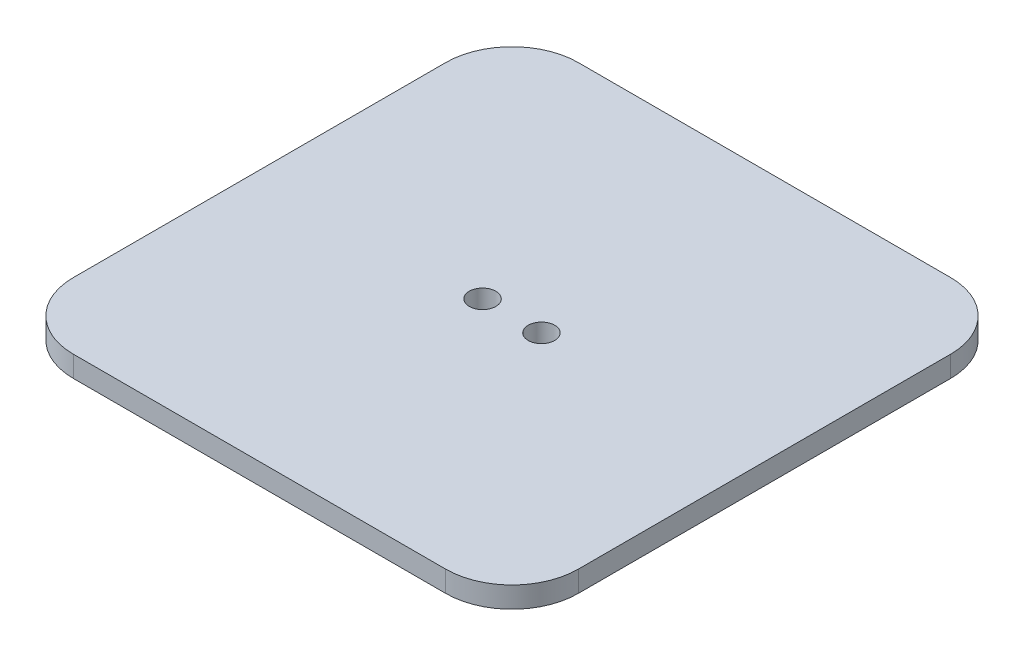
ISO-10303-21;
HEADER;
FILE_DESCRIPTION(('STEP AP214'),'2;1');
FILE_NAME('part.step','',(''),(''),'','','');
FILE_SCHEMA(('AUTOMOTIVE_DESIGN { 1 0 10303 214 1 1 1 1 }'));
ENDSEC;
DATA;
#1=APPLICATION_CONTEXT('core data for automotive mechanical design processes');
#2=APPLICATION_PROTOCOL_DEFINITION('international standard','automotive_design',2000,#1);
#3=PRODUCT_CONTEXT('',#1,'mechanical');
#4=PRODUCT('Part','Part','',(#3));
#5=PRODUCT_RELATED_PRODUCT_CATEGORY('part','',(#4));
#6=PRODUCT_DEFINITION_FORMATION('','',#4);
#7=PRODUCT_DEFINITION_CONTEXT('part definition',#1,'design');
#8=PRODUCT_DEFINITION('design','',#6,#7);
#9=PRODUCT_DEFINITION_SHAPE('','',#8);
#10=(LENGTH_UNIT() NAMED_UNIT(*) SI_UNIT(.MILLI.,.METRE.));
#11=(NAMED_UNIT(*) PLANE_ANGLE_UNIT() SI_UNIT($,.RADIAN.));
#12=(NAMED_UNIT(*) SI_UNIT($,.STERADIAN.) SOLID_ANGLE_UNIT());
#13=UNCERTAINTY_MEASURE_WITH_UNIT(LENGTH_MEASURE(1.E-05),#10,'distance_accuracy_value','');
#14=(GEOMETRIC_REPRESENTATION_CONTEXT(3) GLOBAL_UNCERTAINTY_ASSIGNED_CONTEXT((#13)) GLOBAL_UNIT_ASSIGNED_CONTEXT((#10,
#11,#12)) REPRESENTATION_CONTEXT('',''));
#15=CARTESIAN_POINT('',(0.,0.,0.));
#16=DIRECTION('',(0.,0.,1.));
#17=DIRECTION('',(1.,0.,0.));
#18=AXIS2_PLACEMENT_3D('',#15,#16,#17);
#19=CARTESIAN_POINT('',(38.1,3.175,38.1));
#20=DIRECTION('',(-1.,0.,0.));
#21=DIRECTION('',(0.,0.,1.));
#22=AXIS2_PLACEMENT_3D('',#19,#20,#21);
#23=PLANE('',#22);
#24=DIRECTION('',(0.,0.,-1.));
#25=VECTOR('',#24,1.);
#26=CARTESIAN_POINT('',(38.1,3.175,38.1));
#27=LINE('',#26,#25);
#28=CARTESIAN_POINT('',(38.1,3.175,28.1));
#29=VERTEX_POINT('',#28);
#30=CARTESIAN_POINT('',(38.1,3.175,-28.1));
#31=VERTEX_POINT('',#30);
#32=EDGE_CURVE('E127',#29,#31,#27,.T.);
#33=ORIENTED_EDGE('',*,*,#32,.F.);
#34=DIRECTION('',(0.,-1.,0.));
#35=VECTOR('',#34,1.);
#36=CARTESIAN_POINT('',(38.1,3.175,28.1));
#37=LINE('',#36,#35);
#38=CARTESIAN_POINT('',(38.1,0.,28.1));
#39=VERTEX_POINT('',#38);
#40=EDGE_CURVE('E173',#29,#39,#37,.T.);
#41=ORIENTED_EDGE('',*,*,#40,.T.);
#42=DIRECTION('',(0.,0.,-1.));
#43=VECTOR('',#42,1.);
#44=CARTESIAN_POINT('',(38.1,0.,38.1));
#45=LINE('',#44,#43);
#46=CARTESIAN_POINT('',(38.1,0.,-28.1));
#47=VERTEX_POINT('',#46);
#48=EDGE_CURVE('E190',#39,#47,#45,.T.);
#49=ORIENTED_EDGE('',*,*,#48,.T.);
#50=DIRECTION('',(0.,-1.,0.));
#51=VECTOR('',#50,1.);
#52=CARTESIAN_POINT('',(38.1,3.175,-28.1));
#53=LINE('',#52,#51);
#54=EDGE_CURVE('E166',#47,#31,#53,.F.);
#55=ORIENTED_EDGE('',*,*,#54,.T.);
#56=EDGE_LOOP('',(#33,#41,#49,#55));
#57=FACE_BOUND('',#56,.T.);
#58=ADVANCED_FACE('F43',(#57),#23,.F.);
#59=CARTESIAN_POINT('',(-38.1,3.175,-38.1));
#60=DIRECTION('',(0.,0.,1.));
#61=DIRECTION('',(1.,0.,0.));
#62=AXIS2_PLACEMENT_3D('',#59,#60,#61);
#63=PLANE('',#62);
#64=DIRECTION('',(-1.,0.,0.));
#65=VECTOR('',#64,1.);
#66=CARTESIAN_POINT('',(-38.1,3.175,-38.1));
#67=LINE('',#66,#65);
#68=CARTESIAN_POINT('',(28.1,3.175,-38.1));
#69=VERTEX_POINT('',#68);
#70=CARTESIAN_POINT('',(-28.1,3.175,-38.1));
#71=VERTEX_POINT('',#70);
#72=EDGE_CURVE('E132',#69,#71,#67,.T.);
#73=ORIENTED_EDGE('',*,*,#72,.F.);
#74=DIRECTION('',(0.,-1.,0.));
#75=VECTOR('',#74,1.);
#76=CARTESIAN_POINT('',(28.1,3.175,-38.1));
#77=LINE('',#76,#75);
#78=CARTESIAN_POINT('',(28.1,0.,-38.1));
#79=VERTEX_POINT('',#78);
#80=EDGE_CURVE('E158',#69,#79,#77,.T.);
#81=ORIENTED_EDGE('',*,*,#80,.T.);
#82=DIRECTION('',(-1.,0.,0.));
#83=VECTOR('',#82,1.);
#84=CARTESIAN_POINT('',(-38.1,0.,-38.1));
#85=LINE('',#84,#83);
#86=CARTESIAN_POINT('',(-28.1,0.,-38.1));
#87=VERTEX_POINT('',#86);
#88=EDGE_CURVE('E134',#79,#87,#85,.T.);
#89=ORIENTED_EDGE('',*,*,#88,.T.);
#90=DIRECTION('',(0.,-1.,0.));
#91=VECTOR('',#90,1.);
#92=CARTESIAN_POINT('',(-28.1,3.175,-38.1));
#93=LINE('',#92,#91);
#94=EDGE_CURVE('E151',#87,#71,#93,.F.);
#95=ORIENTED_EDGE('',*,*,#94,.T.);
#96=EDGE_LOOP('',(#73,#81,#89,#95));
#97=FACE_BOUND('',#96,.T.);
#98=ADVANCED_FACE('F196',(#97),#63,.F.);
#99=CARTESIAN_POINT('',(-38.1,3.175,38.1));
#100=DIRECTION('',(1.,0.,0.));
#101=DIRECTION('',(0.,0.,-1.));
#102=AXIS2_PLACEMENT_3D('',#99,#100,#101);
#103=PLANE('',#102);
#104=DIRECTION('',(0.,0.,1.));
#105=VECTOR('',#104,1.);
#106=CARTESIAN_POINT('',(-38.1,3.175,38.1));
#107=LINE('',#106,#105);
#108=CARTESIAN_POINT('',(-38.1,3.175,-28.1));
#109=VERTEX_POINT('',#108);
#110=CARTESIAN_POINT('',(-38.1,3.175,28.1));
#111=VERTEX_POINT('',#110);
#112=EDGE_CURVE('E181',#109,#111,#107,.T.);
#113=ORIENTED_EDGE('',*,*,#112,.F.);
#114=DIRECTION('',(0.,-1.,0.));
#115=VECTOR('',#114,1.);
#116=CARTESIAN_POINT('',(-38.1,3.175,-28.1));
#117=LINE('',#116,#115);
#118=CARTESIAN_POINT('',(-38.1,0.,-28.1));
#119=VERTEX_POINT('',#118);
#120=EDGE_CURVE('E143',#109,#119,#117,.T.);
#121=ORIENTED_EDGE('',*,*,#120,.T.);
#122=DIRECTION('',(0.,0.,1.));
#123=VECTOR('',#122,1.);
#124=CARTESIAN_POINT('',(-38.1,0.,38.1));
#125=LINE('',#124,#123);
#126=CARTESIAN_POINT('',(-38.1,0.,28.1));
#127=VERTEX_POINT('',#126);
#128=EDGE_CURVE('E128',#119,#127,#125,.T.);
#129=ORIENTED_EDGE('',*,*,#128,.T.);
#130=DIRECTION('',(0.,-1.,0.));
#131=VECTOR('',#130,1.);
#132=CARTESIAN_POINT('',(-38.1,3.175,28.1));
#133=LINE('',#132,#131);
#134=EDGE_CURVE('E116',#127,#111,#133,.F.);
#135=ORIENTED_EDGE('',*,*,#134,.T.);
#136=EDGE_LOOP('',(#113,#121,#129,#135));
#137=FACE_BOUND('',#136,.T.);
#138=ADVANCED_FACE('F206',(#137),#103,.F.);
#139=CARTESIAN_POINT('',(-38.1,3.175,38.1));
#140=DIRECTION('',(0.,0.,-1.));
#141=DIRECTION('',(-1.,0.,0.));
#142=AXIS2_PLACEMENT_3D('',#139,#140,#141);
#143=PLANE('',#142);
#144=DIRECTION('',(1.,0.,0.));
#145=VECTOR('',#144,1.);
#146=CARTESIAN_POINT('',(-38.1,0.,38.1));
#147=LINE('',#146,#145);
#148=CARTESIAN_POINT('',(-28.1,0.,38.1));
#149=VERTEX_POINT('',#148);
#150=CARTESIAN_POINT('',(28.1,0.,38.1));
#151=VERTEX_POINT('',#150);
#152=EDGE_CURVE('E121',#149,#151,#147,.T.);
#153=ORIENTED_EDGE('',*,*,#152,.T.);
#154=DIRECTION('',(0.,-1.,0.));
#155=VECTOR('',#154,1.);
#156=CARTESIAN_POINT('',(28.1,3.175,38.1));
#157=LINE('',#156,#155);
#158=CARTESIAN_POINT('',(28.1,3.175,38.1));
#159=VERTEX_POINT('',#158);
#160=EDGE_CURVE('E52',#151,#159,#157,.F.);
#161=ORIENTED_EDGE('',*,*,#160,.T.);
#162=DIRECTION('',(1.,0.,0.));
#163=VECTOR('',#162,1.);
#164=CARTESIAN_POINT('',(-38.1,3.175,38.1));
#165=LINE('',#164,#163);
#166=CARTESIAN_POINT('',(-28.1,3.175,38.1));
#167=VERTEX_POINT('',#166);
#168=EDGE_CURVE('E122',#167,#159,#165,.T.);
#169=ORIENTED_EDGE('',*,*,#168,.F.);
#170=DIRECTION('',(0.,-1.,0.));
#171=VECTOR('',#170,1.);
#172=CARTESIAN_POINT('',(-28.1,3.175,38.1));
#173=LINE('',#172,#171);
#174=EDGE_CURVE('E114',#167,#149,#173,.T.);
#175=ORIENTED_EDGE('',*,*,#174,.T.);
#176=EDGE_LOOP('',(#153,#161,#169,#175));
#177=FACE_BOUND('',#176,.T.);
#178=ADVANCED_FACE('F120',(#177),#143,.F.);
#179=CARTESIAN_POINT('',(0.,3.175,0.));
#180=DIRECTION('',(0.,-1.,0.));
#181=DIRECTION('',(0.,0.,-1.));
#182=AXIS2_PLACEMENT_3D('',#179,#180,#181);
#183=PLANE('',#182);
#184=CARTESIAN_POINT('',(4.445,3.175,0.));
#185=DIRECTION('',(0.,1.,0.));
#186=DIRECTION('',(0.,0.,1.));
#187=AXIS2_PLACEMENT_3D('',#184,#185,#186);
#188=CIRCLE('',#187,2.);
#189=CARTESIAN_POINT('',(4.445,3.175,2.));
#190=VERTEX_POINT('',#189);
#191=EDGE_CURVE('E345',#190,#190,#188,.T.);
#192=ORIENTED_EDGE('',*,*,#191,.F.);
#193=EDGE_LOOP('',(#192));
#194=FACE_BOUND('',#193,.T.);
#195=CARTESIAN_POINT('',(-4.445,3.175,0.));
#196=DIRECTION('',(0.,1.,0.));
#197=DIRECTION('',(0.,0.,1.));
#198=AXIS2_PLACEMENT_3D('',#195,#196,#197);
#199=CIRCLE('',#198,2.);
#200=CARTESIAN_POINT('',(-4.445,3.175,2.));
#201=VERTEX_POINT('',#200);
#202=EDGE_CURVE('E347',#201,#201,#199,.T.);
#203=ORIENTED_EDGE('',*,*,#202,.F.);
#204=EDGE_LOOP('',(#203));
#205=FACE_BOUND('',#204,.T.);
#206=ORIENTED_EDGE('',*,*,#168,.T.);
#207=CARTESIAN_POINT('',(28.1,3.175,28.1));
#208=DIRECTION('',(0.,-1.,0.));
#209=DIRECTION('',(0.,0.,-1.));
#210=AXIS2_PLACEMENT_3D('',#207,#208,#209);
#211=CIRCLE('',#210,10.);
#212=EDGE_CURVE('E11',#159,#29,#211,.F.);
#213=ORIENTED_EDGE('',*,*,#212,.T.);
#214=ORIENTED_EDGE('',*,*,#32,.T.);
#215=CARTESIAN_POINT('',(28.1,3.175,-28.1));
#216=DIRECTION('',(0.,-1.,0.));
#217=DIRECTION('',(0.,0.,-1.));
#218=AXIS2_PLACEMENT_3D('',#215,#216,#217);
#219=CIRCLE('',#218,10.);
#220=EDGE_CURVE('E170',#31,#69,#219,.F.);
#221=ORIENTED_EDGE('',*,*,#220,.T.);
#222=ORIENTED_EDGE('',*,*,#72,.T.);
#223=CARTESIAN_POINT('',(-28.1,3.175,-28.1));
#224=DIRECTION('',(0.,-1.,0.));
#225=DIRECTION('',(0.,0.,-1.));
#226=AXIS2_PLACEMENT_3D('',#223,#224,#225);
#227=CIRCLE('',#226,10.);
#228=EDGE_CURVE('E155',#71,#109,#227,.F.);
#229=ORIENTED_EDGE('',*,*,#228,.T.);
#230=ORIENTED_EDGE('',*,*,#112,.T.);
#231=CARTESIAN_POINT('',(-28.1,3.175,28.1));
#232=DIRECTION('',(0.,-1.,0.));
#233=DIRECTION('',(0.,0.,-1.));
#234=AXIS2_PLACEMENT_3D('',#231,#232,#233);
#235=CIRCLE('',#234,10.);
#236=EDGE_CURVE('E140',#111,#167,#235,.F.);
#237=ORIENTED_EDGE('',*,*,#236,.T.);
#238=EDGE_LOOP('',(#206,#213,#214,#221,#222,#229,#230,#237));
#239=FACE_BOUND('',#238,.T.);
#240=ADVANCED_FACE('F204',(#194,#205,#239),#183,.F.);
#241=CARTESIAN_POINT('',(0.,0.,0.));
#242=DIRECTION('',(0.,-1.,0.));
#243=DIRECTION('',(0.,0.,-1.));
#244=AXIS2_PLACEMENT_3D('',#241,#242,#243);
#245=PLANE('',#244);
#246=CARTESIAN_POINT('',(4.445,0.,0.));
#247=DIRECTION('',(0.,1.,0.));
#248=DIRECTION('',(0.,0.,1.));
#249=AXIS2_PLACEMENT_3D('',#246,#247,#248);
#250=CIRCLE('',#249,2.);
#251=CARTESIAN_POINT('',(4.445,0.,2.));
#252=VERTEX_POINT('',#251);
#253=EDGE_CURVE('E192',#252,#252,#250,.T.);
#254=ORIENTED_EDGE('',*,*,#253,.T.);
#255=EDGE_LOOP('',(#254));
#256=FACE_BOUND('',#255,.T.);
#257=CARTESIAN_POINT('',(-4.445,0.,0.));
#258=DIRECTION('',(0.,1.,0.));
#259=DIRECTION('',(0.,0.,1.));
#260=AXIS2_PLACEMENT_3D('',#257,#258,#259);
#261=CIRCLE('',#260,2.);
#262=CARTESIAN_POINT('',(-4.445,0.,2.));
#263=VERTEX_POINT('',#262);
#264=EDGE_CURVE('E353',#263,#263,#261,.T.);
#265=ORIENTED_EDGE('',*,*,#264,.T.);
#266=EDGE_LOOP('',(#265));
#267=FACE_BOUND('',#266,.T.);
#268=ORIENTED_EDGE('',*,*,#48,.F.);
#269=CARTESIAN_POINT('',(28.1,0.,28.1));
#270=DIRECTION('',(0.,-1.,0.));
#271=DIRECTION('',(0.,0.,-1.));
#272=AXIS2_PLACEMENT_3D('',#269,#270,#271);
#273=CIRCLE('',#272,10.);
#274=EDGE_CURVE('E66',#39,#151,#273,.T.);
#275=ORIENTED_EDGE('',*,*,#274,.T.);
#276=ORIENTED_EDGE('',*,*,#152,.F.);
#277=CARTESIAN_POINT('',(-28.1,0.,28.1));
#278=DIRECTION('',(0.,-1.,0.));
#279=DIRECTION('',(0.,0.,-1.));
#280=AXIS2_PLACEMENT_3D('',#277,#278,#279);
#281=CIRCLE('',#280,10.);
#282=EDGE_CURVE('E110',#149,#127,#281,.T.);
#283=ORIENTED_EDGE('',*,*,#282,.T.);
#284=ORIENTED_EDGE('',*,*,#128,.F.);
#285=CARTESIAN_POINT('',(-28.1,0.,-28.1));
#286=DIRECTION('',(0.,-1.,0.));
#287=DIRECTION('',(0.,0.,-1.));
#288=AXIS2_PLACEMENT_3D('',#285,#286,#287);
#289=CIRCLE('',#288,10.);
#290=EDGE_CURVE('E147',#119,#87,#289,.T.);
#291=ORIENTED_EDGE('',*,*,#290,.T.);
#292=ORIENTED_EDGE('',*,*,#88,.F.);
#293=CARTESIAN_POINT('',(28.1,0.,-28.1));
#294=DIRECTION('',(0.,-1.,0.));
#295=DIRECTION('',(0.,0.,-1.));
#296=AXIS2_PLACEMENT_3D('',#293,#294,#295);
#297=CIRCLE('',#296,10.);
#298=EDGE_CURVE('E162',#79,#47,#297,.T.);
#299=ORIENTED_EDGE('',*,*,#298,.T.);
#300=EDGE_LOOP('',(#268,#275,#276,#283,#284,#291,#292,#299));
#301=FACE_BOUND('',#300,.T.);
#302=ADVANCED_FACE('F125',(#256,#267,#301),#245,.T.);
#303=CARTESIAN_POINT('',(-28.1,3.175,28.1));
#304=DIRECTION('',(0.,-1.,0.));
#305=DIRECTION('',(0.,0.,-1.));
#306=AXIS2_PLACEMENT_3D('',#303,#304,#305);
#307=CYLINDRICAL_SURFACE('',#306,10.);
#308=ORIENTED_EDGE('',*,*,#236,.F.);
#309=ORIENTED_EDGE('',*,*,#134,.F.);
#310=ORIENTED_EDGE('',*,*,#282,.F.);
#311=ORIENTED_EDGE('',*,*,#174,.F.);
#312=EDGE_LOOP('',(#308,#309,#310,#311));
#313=FACE_BOUND('',#312,.T.);
#314=ADVANCED_FACE('F113',(#313),#307,.T.);
#315=CARTESIAN_POINT('',(-28.1,3.175,-28.1));
#316=DIRECTION('',(0.,-1.,0.));
#317=DIRECTION('',(0.,0.,-1.));
#318=AXIS2_PLACEMENT_3D('',#315,#316,#317);
#319=CYLINDRICAL_SURFACE('',#318,10.);
#320=ORIENTED_EDGE('',*,*,#228,.F.);
#321=ORIENTED_EDGE('',*,*,#94,.F.);
#322=ORIENTED_EDGE('',*,*,#290,.F.);
#323=ORIENTED_EDGE('',*,*,#120,.F.);
#324=EDGE_LOOP('',(#320,#321,#322,#323));
#325=FACE_BOUND('',#324,.T.);
#326=ADVANCED_FACE('F202',(#325),#319,.T.);
#327=CARTESIAN_POINT('',(28.1,3.175,-28.1));
#328=DIRECTION('',(0.,-1.,0.));
#329=DIRECTION('',(0.,0.,-1.));
#330=AXIS2_PLACEMENT_3D('',#327,#328,#329);
#331=CYLINDRICAL_SURFACE('',#330,10.);
#332=ORIENTED_EDGE('',*,*,#220,.F.);
#333=ORIENTED_EDGE('',*,*,#54,.F.);
#334=ORIENTED_EDGE('',*,*,#298,.F.);
#335=ORIENTED_EDGE('',*,*,#80,.F.);
#336=EDGE_LOOP('',(#332,#333,#334,#335));
#337=FACE_BOUND('',#336,.T.);
#338=ADVANCED_FACE('F215',(#337),#331,.T.);
#339=CARTESIAN_POINT('',(28.1,3.175,28.1));
#340=DIRECTION('',(0.,-1.,0.));
#341=DIRECTION('',(0.,0.,-1.));
#342=AXIS2_PLACEMENT_3D('',#339,#340,#341);
#343=CYLINDRICAL_SURFACE('',#342,10.);
#344=ORIENTED_EDGE('',*,*,#212,.F.);
#345=ORIENTED_EDGE('',*,*,#160,.F.);
#346=ORIENTED_EDGE('',*,*,#274,.F.);
#347=ORIENTED_EDGE('',*,*,#40,.F.);
#348=EDGE_LOOP('',(#344,#345,#346,#347));
#349=FACE_BOUND('',#348,.T.);
#350=ADVANCED_FACE('F45',(#349),#343,.T.);
#351=CARTESIAN_POINT('',(-4.445,0.,0.));
#352=DIRECTION('',(0.,1.,0.));
#353=DIRECTION('',(0.,0.,1.));
#354=AXIS2_PLACEMENT_3D('',#351,#352,#353);
#355=CYLINDRICAL_SURFACE('',#354,2.);
#356=ORIENTED_EDGE('',*,*,#264,.F.);
#357=EDGE_LOOP('',(#356));
#358=FACE_BOUND('',#357,.T.);
#359=ORIENTED_EDGE('',*,*,#202,.T.);
#360=EDGE_LOOP('',(#359));
#361=FACE_BOUND('',#360,.T.);
#362=ADVANCED_FACE('F221',(#358,#361),#355,.F.);
#363=CARTESIAN_POINT('',(4.445,0.,0.));
#364=DIRECTION('',(0.,1.,0.));
#365=DIRECTION('',(0.,0.,1.));
#366=AXIS2_PLACEMENT_3D('',#363,#364,#365);
#367=CYLINDRICAL_SURFACE('',#366,2.);
#368=ORIENTED_EDGE('',*,*,#253,.F.);
#369=EDGE_LOOP('',(#368));
#370=FACE_BOUND('',#369,.T.);
#371=ORIENTED_EDGE('',*,*,#191,.T.);
#372=EDGE_LOOP('',(#371));
#373=FACE_BOUND('',#372,.T.);
#374=ADVANCED_FACE('F280',(#370,#373),#367,.F.);
#375=CLOSED_SHELL('',(#58,#98,#138,#178,#240,#302,#314,#326,#338,#350,#362,#374));
#376=MANIFOLD_SOLID_BREP('B2',#375);
#377=ADVANCED_BREP_SHAPE_REPRESENTATION('',(#18,#376),#14);
#378=SHAPE_DEFINITION_REPRESENTATION(#9,#377);
ENDSEC;
END-ISO-10303-21;
